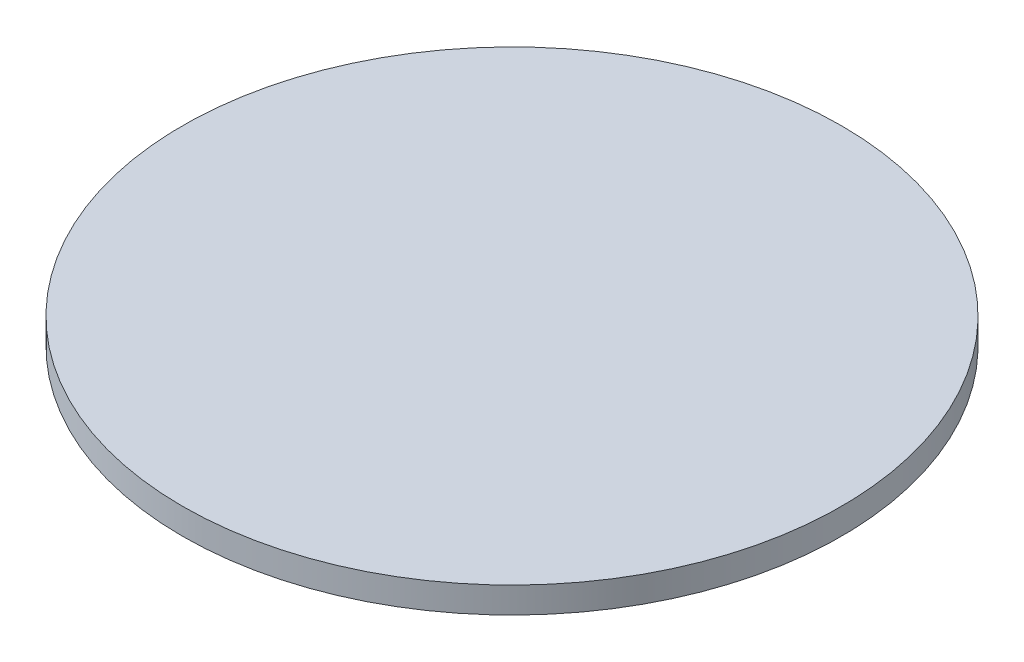
ISO-10303-21;
HEADER;
FILE_DESCRIPTION(('STEP AP214'),'2;1');
FILE_NAME('part.step','',(''),(''),'','','');
FILE_SCHEMA(('AUTOMOTIVE_DESIGN { 1 0 10303 214 1 1 1 1 }'));
ENDSEC;
DATA;
#1=APPLICATION_CONTEXT('core data for automotive mechanical design processes');
#2=APPLICATION_PROTOCOL_DEFINITION('international standard','automotive_design',2000,#1);
#3=PRODUCT_CONTEXT('',#1,'mechanical');
#4=PRODUCT('Part','Part','',(#3));
#5=PRODUCT_RELATED_PRODUCT_CATEGORY('part','',(#4));
#6=PRODUCT_DEFINITION_FORMATION('','',#4);
#7=PRODUCT_DEFINITION_CONTEXT('part definition',#1,'design');
#8=PRODUCT_DEFINITION('design','',#6,#7);
#9=PRODUCT_DEFINITION_SHAPE('','',#8);
#10=(LENGTH_UNIT() NAMED_UNIT(*) SI_UNIT(.MILLI.,.METRE.));
#11=(NAMED_UNIT(*) PLANE_ANGLE_UNIT() SI_UNIT($,.RADIAN.));
#12=(NAMED_UNIT(*) SI_UNIT($,.STERADIAN.) SOLID_ANGLE_UNIT());
#13=UNCERTAINTY_MEASURE_WITH_UNIT(LENGTH_MEASURE(1.E-05),#10,'distance_accuracy_value','');
#14=(GEOMETRIC_REPRESENTATION_CONTEXT(3) GLOBAL_UNCERTAINTY_ASSIGNED_CONTEXT((#13)) GLOBAL_UNIT_ASSIGNED_CONTEXT((#10,
#11,#12)) REPRESENTATION_CONTEXT('',''));
#15=CARTESIAN_POINT('',(0.,0.,0.));
#16=DIRECTION('',(0.,0.,1.));
#17=DIRECTION('',(1.,0.,0.));
#18=AXIS2_PLACEMENT_3D('',#15,#16,#17);
#19=CARTESIAN_POINT('',(0.,2.0066,0.));
#20=DIRECTION('',(0.,-1.,0.));
#21=DIRECTION('',(0.,0.,-1.));
#22=AXIS2_PLACEMENT_3D('',#19,#20,#21);
#23=CYLINDRICAL_SURFACE('',#22,25.4508);
#24=CARTESIAN_POINT('',(0.,2.0066,0.));
#25=DIRECTION('',(0.,1.,0.));
#26=DIRECTION('',(0.,0.,1.));
#27=AXIS2_PLACEMENT_3D('',#24,#25,#26);
#28=CIRCLE('',#27,25.4508);
#29=CARTESIAN_POINT('',(0.,2.0066,25.4508));
#30=VERTEX_POINT('',#29);
#31=EDGE_CURVE('E10',#30,#30,#28,.T.);
#32=ORIENTED_EDGE('',*,*,#31,.F.);
#33=EDGE_LOOP('',(#32));
#34=FACE_BOUND('',#33,.T.);
#35=CARTESIAN_POINT('',(0.,0.,0.));
#36=DIRECTION('',(0.,1.,0.));
#37=DIRECTION('',(0.,0.,1.));
#38=AXIS2_PLACEMENT_3D('',#35,#36,#37);
#39=CIRCLE('',#38,25.4508);
#40=CARTESIAN_POINT('',(0.,0.,25.4508));
#41=VERTEX_POINT('',#40);
#42=EDGE_CURVE('E37',#41,#41,#39,.T.);
#43=ORIENTED_EDGE('',*,*,#42,.T.);
#44=EDGE_LOOP('',(#43));
#45=FACE_BOUND('',#44,.T.);
#46=ADVANCED_FACE('F34',(#34,#45),#23,.T.);
#47=CARTESIAN_POINT('',(0.,2.0066,0.));
#48=DIRECTION('',(0.,1.,0.));
#49=DIRECTION('',(0.,0.,1.));
#50=AXIS2_PLACEMENT_3D('',#47,#48,#49);
#51=PLANE('',#50);
#52=ORIENTED_EDGE('',*,*,#31,.T.);
#53=EDGE_LOOP('',(#52));
#54=FACE_BOUND('',#53,.T.);
#55=ADVANCED_FACE('F49',(#54),#51,.T.);
#56=CARTESIAN_POINT('',(0.,0.,0.));
#57=DIRECTION('',(0.,1.,0.));
#58=DIRECTION('',(0.,0.,1.));
#59=AXIS2_PLACEMENT_3D('',#56,#57,#58);
#60=PLANE('',#59);
#61=ORIENTED_EDGE('',*,*,#42,.F.);
#62=EDGE_LOOP('',(#61));
#63=FACE_BOUND('',#62,.T.);
#64=ADVANCED_FACE('F47',(#63),#60,.F.);
#65=CLOSED_SHELL('',(#46,#55,#64));
#66=MANIFOLD_SOLID_BREP('B2',#65);
#67=ADVANCED_BREP_SHAPE_REPRESENTATION('',(#18,#66),#14);
#68=SHAPE_DEFINITION_REPRESENTATION(#9,#67);
ENDSEC;
END-ISO-10303-21;
